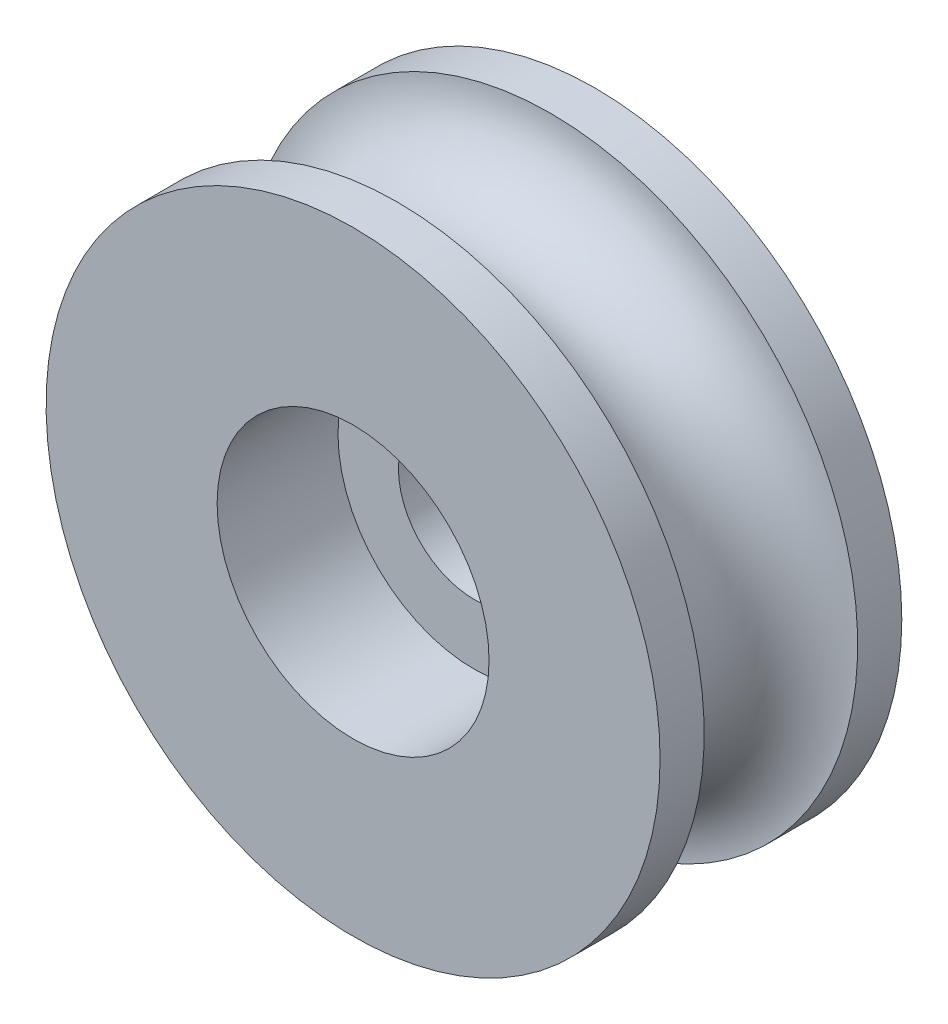
ISO-10303-21;
HEADER;
FILE_DESCRIPTION(('STEP AP214'),'2;1');
FILE_NAME('part.step','',(''),(''),'','','');
FILE_SCHEMA(('AUTOMOTIVE_DESIGN { 1 0 10303 214 1 1 1 1 }'));
ENDSEC;
DATA;
#1=APPLICATION_CONTEXT('core data for automotive mechanical design processes');
#2=APPLICATION_PROTOCOL_DEFINITION('international standard','automotive_design',2000,#1);
#3=PRODUCT_CONTEXT('',#1,'mechanical');
#4=PRODUCT('Part','Part','',(#3));
#5=PRODUCT_RELATED_PRODUCT_CATEGORY('part','',(#4));
#6=PRODUCT_DEFINITION_FORMATION('','',#4);
#7=PRODUCT_DEFINITION_CONTEXT('part definition',#1,'design');
#8=PRODUCT_DEFINITION('design','',#6,#7);
#9=PRODUCT_DEFINITION_SHAPE('','',#8);
#10=(LENGTH_UNIT() NAMED_UNIT(*) SI_UNIT(.MILLI.,.METRE.));
#11=(NAMED_UNIT(*) PLANE_ANGLE_UNIT() SI_UNIT($,.RADIAN.));
#12=(NAMED_UNIT(*) SI_UNIT($,.STERADIAN.) SOLID_ANGLE_UNIT());
#13=UNCERTAINTY_MEASURE_WITH_UNIT(LENGTH_MEASURE(1.E-05),#10,'distance_accuracy_value','');
#14=(GEOMETRIC_REPRESENTATION_CONTEXT(3) GLOBAL_UNCERTAINTY_ASSIGNED_CONTEXT((#13)) GLOBAL_UNIT_ASSIGNED_CONTEXT((#10,
#11,#12)) REPRESENTATION_CONTEXT('',''));
#15=CARTESIAN_POINT('',(0.,0.,0.));
#16=DIRECTION('',(0.,0.,1.));
#17=DIRECTION('',(1.,0.,0.));
#18=AXIS2_PLACEMENT_3D('',#15,#16,#17);
#19=CARTESIAN_POINT('',(0.,0.,8.));
#20=DIRECTION('',(0.,0.,-1.));
#21=DIRECTION('',(-1.,0.,0.));
#22=AXIS2_PLACEMENT_3D('',#19,#20,#21);
#23=CYLINDRICAL_SURFACE('',#22,4.5);
#24=CARTESIAN_POINT('',(0.,0.,8.));
#25=DIRECTION('',(0.,0.,1.));
#26=DIRECTION('',(1.,0.,0.));
#27=AXIS2_PLACEMENT_3D('',#24,#25,#26);
#28=CIRCLE('',#27,4.5);
#29=CARTESIAN_POINT('',(4.5,0.,8.));
#30=VERTEX_POINT('',#29);
#31=EDGE_CURVE('E41',#30,#30,#28,.T.);
#32=ORIENTED_EDGE('',*,*,#31,.T.);
#33=EDGE_LOOP('',(#32));
#34=FACE_BOUND('',#33,.T.);
#35=CARTESIAN_POINT('',(0.,0.,4.));
#36=DIRECTION('',(0.,0.,-1.));
#37=DIRECTION('',(-1.,0.,0.));
#38=AXIS2_PLACEMENT_3D('',#35,#36,#37);
#39=CIRCLE('',#38,4.5);
#40=CARTESIAN_POINT('',(-4.5,0.,4.));
#41=VERTEX_POINT('',#40);
#42=EDGE_CURVE('E51',#41,#41,#39,.T.);
#43=ORIENTED_EDGE('',*,*,#42,.T.);
#44=EDGE_LOOP('',(#43));
#45=FACE_BOUND('',#44,.T.);
#46=ADVANCED_FACE('F30',(#34,#45),#23,.F.);
#47=CARTESIAN_POINT('',(0.,0.,8.));
#48=DIRECTION('',(0.,0.,-1.));
#49=DIRECTION('',(-1.,0.,0.));
#50=AXIS2_PLACEMENT_3D('',#47,#48,#49);
#51=CYLINDRICAL_SURFACE('',#50,10.16);
#52=CARTESIAN_POINT('',(0.,0.,1.46));
#53=DIRECTION('',(0.,0.,-1.));
#54=DIRECTION('',(0.,1.,0.));
#55=AXIS2_PLACEMENT_3D('',#52,#53,#54);
#56=CIRCLE('',#55,10.16);
#57=CARTESIAN_POINT('',(0.,10.16,1.46));
#58=VERTEX_POINT('',#57);
#59=EDGE_CURVE('E45',#58,#58,#56,.T.);
#60=ORIENTED_EDGE('',*,*,#59,.T.);
#61=EDGE_LOOP('',(#60));
#62=FACE_BOUND('',#61,.T.);
#63=CARTESIAN_POINT('',(0.,0.,0.));
#64=DIRECTION('',(0.,0.,1.));
#65=DIRECTION('',(1.,0.,0.));
#66=AXIS2_PLACEMENT_3D('',#63,#64,#65);
#67=CIRCLE('',#66,10.16);
#68=CARTESIAN_POINT('',(10.16,0.,0.));
#69=VERTEX_POINT('',#68);
#70=EDGE_CURVE('E34',#69,#69,#67,.T.);
#71=ORIENTED_EDGE('',*,*,#70,.T.);
#72=EDGE_LOOP('',(#71));
#73=FACE_BOUND('',#72,.T.);
#74=ADVANCED_FACE('F80',(#62,#73),#51,.T.);
#75=CARTESIAN_POINT('',(0.,0.,8.));
#76=DIRECTION('',(0.,0.,1.));
#77=DIRECTION('',(1.,0.,0.));
#78=AXIS2_PLACEMENT_3D('',#75,#76,#77);
#79=PLANE('',#78);
#80=CARTESIAN_POINT('',(0.,0.,8.));
#81=DIRECTION('',(0.,0.,1.));
#82=DIRECTION('',(1.,0.,0.));
#83=AXIS2_PLACEMENT_3D('',#80,#81,#82);
#84=CIRCLE('',#83,10.16);
#85=CARTESIAN_POINT('',(10.16,0.,8.));
#86=VERTEX_POINT('',#85);
#87=EDGE_CURVE('E10',#86,#86,#84,.T.);
#88=ORIENTED_EDGE('',*,*,#87,.T.);
#89=EDGE_LOOP('',(#88));
#90=FACE_BOUND('',#89,.T.);
#91=ORIENTED_EDGE('',*,*,#31,.F.);
#92=EDGE_LOOP('',(#91));
#93=FACE_BOUND('',#92,.T.);
#94=ADVANCED_FACE('F72',(#90,#93),#79,.T.);
#95=CARTESIAN_POINT('',(0.,0.,0.));
#96=DIRECTION('',(0.,0.,1.));
#97=DIRECTION('',(1.,0.,0.));
#98=AXIS2_PLACEMENT_3D('',#95,#96,#97);
#99=PLANE('',#98);
#100=ORIENTED_EDGE('',*,*,#70,.F.);
#101=EDGE_LOOP('',(#100));
#102=FACE_BOUND('',#101,.T.);
#103=CARTESIAN_POINT('',(0.,0.,0.));
#104=DIRECTION('',(0.,0.,-1.));
#105=DIRECTION('',(-1.,0.,0.));
#106=AXIS2_PLACEMENT_3D('',#103,#104,#105);
#107=CIRCLE('',#106,2.5);
#108=CARTESIAN_POINT('',(-2.5,0.,0.));
#109=VERTEX_POINT('',#108);
#110=EDGE_CURVE('E55',#109,#109,#107,.T.);
#111=ORIENTED_EDGE('',*,*,#110,.F.);
#112=EDGE_LOOP('',(#111));
#113=FACE_BOUND('',#112,.T.);
#114=ADVANCED_FACE('F70',(#102,#113),#99,.F.);
#115=CARTESIAN_POINT('',(0.,0.,6.54));
#116=DIRECTION('',(0.,0.,-1.));
#117=DIRECTION('',(0.,1.,0.));
#118=AXIS2_PLACEMENT_3D('',#115,#116,#117);
#119=CIRCLE('',#118,10.16);
#120=CARTESIAN_POINT('',(0.,10.16,6.54));
#121=VERTEX_POINT('',#120);
#122=EDGE_CURVE('E48',#121,#121,#119,.T.);
#123=ORIENTED_EDGE('',*,*,#122,.F.);
#124=EDGE_LOOP('',(#123));
#125=FACE_BOUND('',#124,.T.);
#126=ORIENTED_EDGE('',*,*,#87,.F.);
#127=EDGE_LOOP('',(#126));
#128=FACE_BOUND('',#127,.T.);
#129=ADVANCED_FACE('F32',(#125,#128),#51,.T.);
#130=CARTESIAN_POINT('',(0.,0.,4.));
#131=DIRECTION('',(0.,0.,-1.));
#132=DIRECTION('',(0.,1.,0.));
#133=AXIS2_PLACEMENT_3D('',#130,#131,#132);
#134=TOROIDAL_SURFACE('',#133,10.16,2.54);
#135=ORIENTED_EDGE('',*,*,#59,.F.);
#136=EDGE_LOOP('',(#135));
#137=FACE_BOUND('',#136,.T.);
#138=ORIENTED_EDGE('',*,*,#122,.T.);
#139=EDGE_LOOP('',(#138));
#140=FACE_BOUND('',#139,.T.);
#141=ADVANCED_FACE('F78',(#137,#140),#134,.F.);
#142=CARTESIAN_POINT('',(0.,0.,4.));
#143=DIRECTION('',(0.,0.,-1.));
#144=DIRECTION('',(-1.,0.,0.));
#145=AXIS2_PLACEMENT_3D('',#142,#143,#144);
#146=PLANE('',#145);
#147=CARTESIAN_POINT('',(0.,0.,4.));
#148=DIRECTION('',(0.,0.,-1.));
#149=DIRECTION('',(-1.,0.,0.));
#150=AXIS2_PLACEMENT_3D('',#147,#148,#149);
#151=CIRCLE('',#150,2.5);
#152=CARTESIAN_POINT('',(-2.5,0.,4.));
#153=VERTEX_POINT('',#152);
#154=EDGE_CURVE('E54',#153,#153,#151,.T.);
#155=ORIENTED_EDGE('',*,*,#154,.T.);
#156=EDGE_LOOP('',(#155));
#157=FACE_BOUND('',#156,.T.);
#158=ORIENTED_EDGE('',*,*,#42,.F.);
#159=EDGE_LOOP('',(#158));
#160=FACE_BOUND('',#159,.T.);
#161=ADVANCED_FACE('F61',(#157,#160),#146,.F.);
#162=CARTESIAN_POINT('',(0.,0.,4.));
#163=DIRECTION('',(0.,0.,-1.));
#164=DIRECTION('',(-1.,0.,0.));
#165=AXIS2_PLACEMENT_3D('',#162,#163,#164);
#166=CYLINDRICAL_SURFACE('',#165,2.5);
#167=ORIENTED_EDGE('',*,*,#154,.F.);
#168=EDGE_LOOP('',(#167));
#169=FACE_BOUND('',#168,.T.);
#170=ORIENTED_EDGE('',*,*,#110,.T.);
#171=EDGE_LOOP('',(#170));
#172=FACE_BOUND('',#171,.T.);
#173=ADVANCED_FACE('F64',(#169,#172),#166,.F.);
#174=CLOSED_SHELL('',(#46,#74,#94,#114,#129,#141,#161,#173));
#175=MANIFOLD_SOLID_BREP('B2',#174);
#176=ADVANCED_BREP_SHAPE_REPRESENTATION('',(#18,#175),#14);
#177=SHAPE_DEFINITION_REPRESENTATION(#9,#176);
ENDSEC;
END-ISO-10303-21;
